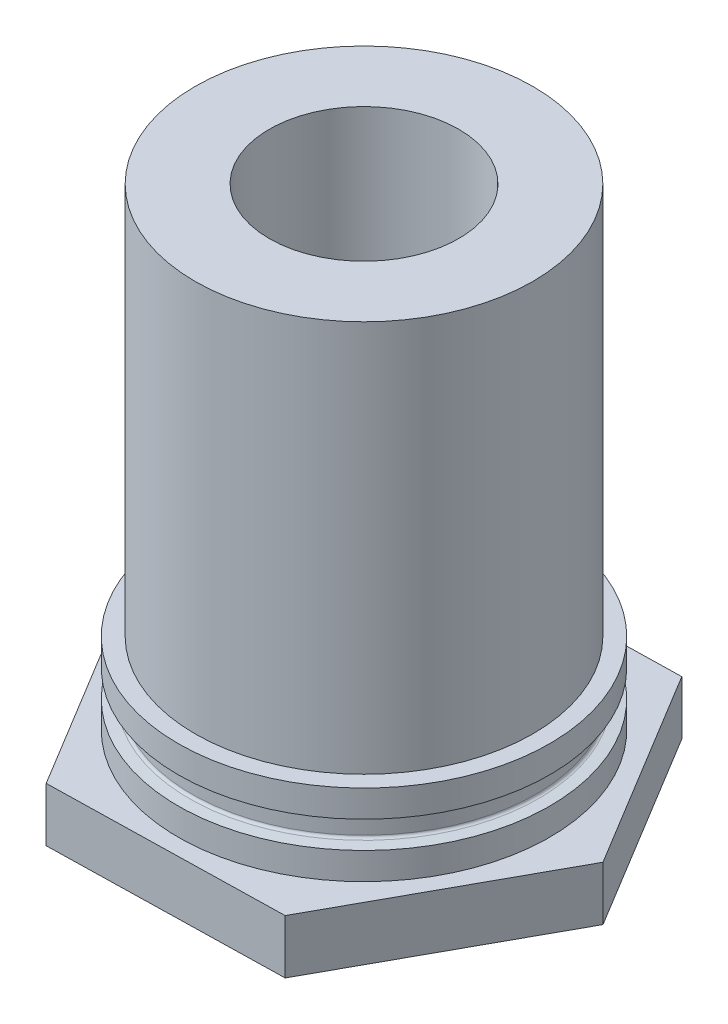
ISO-10303-21;
HEADER;
FILE_DESCRIPTION(('STEP AP214'),'2;1');
FILE_NAME('part.step','',(''),(''),'','','');
FILE_SCHEMA(('AUTOMOTIVE_DESIGN { 1 0 10303 214 1 1 1 1 }'));
ENDSEC;
DATA;
#1=APPLICATION_CONTEXT('core data for automotive mechanical design processes');
#2=APPLICATION_PROTOCOL_DEFINITION('international standard','automotive_design',2000,#1);
#3=PRODUCT_CONTEXT('',#1,'mechanical');
#4=PRODUCT('Part','Part','',(#3));
#5=PRODUCT_RELATED_PRODUCT_CATEGORY('part','',(#4));
#6=PRODUCT_DEFINITION_FORMATION('','',#4);
#7=PRODUCT_DEFINITION_CONTEXT('part definition',#1,'design');
#8=PRODUCT_DEFINITION('design','',#6,#7);
#9=PRODUCT_DEFINITION_SHAPE('','',#8);
#10=(LENGTH_UNIT() NAMED_UNIT(*) SI_UNIT(.MILLI.,.METRE.));
#11=(NAMED_UNIT(*) PLANE_ANGLE_UNIT() SI_UNIT($,.RADIAN.));
#12=(NAMED_UNIT(*) SI_UNIT($,.STERADIAN.) SOLID_ANGLE_UNIT());
#13=UNCERTAINTY_MEASURE_WITH_UNIT(LENGTH_MEASURE(1.E-05),#10,'distance_accuracy_value','');
#14=(GEOMETRIC_REPRESENTATION_CONTEXT(3) GLOBAL_UNCERTAINTY_ASSIGNED_CONTEXT((#13)) GLOBAL_UNIT_ASSIGNED_CONTEXT((#10,
#11,#12)) REPRESENTATION_CONTEXT('',''));
#15=CARTESIAN_POINT('',(0.,0.,0.));
#16=DIRECTION('',(0.,0.,1.));
#17=DIRECTION('',(1.,0.,0.));
#18=AXIS2_PLACEMENT_3D('',#15,#16,#17);
#19=CARTESIAN_POINT('',(0.,110.151211274222,0.));
#20=DIRECTION('',(0.,1.,0.));
#21=DIRECTION('',(0.,0.,1.));
#22=AXIS2_PLACEMENT_3D('',#19,#20,#21);
#23=CYLINDRICAL_SURFACE('',#22,17.4625);
#24=CARTESIAN_POINT('',(0.,5.08192526756477,0.));
#25=DIRECTION('',(0.,1.,0.));
#26=DIRECTION('',(0.,0.,1.));
#27=AXIS2_PLACEMENT_3D('',#24,#25,#26);
#28=CIRCLE('',#27,17.4625);
#29=CARTESIAN_POINT('',(0.,5.08192526756477,17.4625));
#30=VERTEX_POINT('',#29);
#31=EDGE_CURVE('E38',#30,#30,#28,.F.);
#32=ORIENTED_EDGE('',*,*,#31,.F.);
#33=EDGE_LOOP('',(#32));
#34=FACE_BOUND('',#33,.T.);
#35=CARTESIAN_POINT('',(0.,7.62,0.));
#36=DIRECTION('',(0.,1.,0.));
#37=DIRECTION('',(0.,0.,1.));
#38=AXIS2_PLACEMENT_3D('',#35,#36,#37);
#39=CIRCLE('',#38,17.4625);
#40=CARTESIAN_POINT('',(0.,7.62,17.4625));
#41=VERTEX_POINT('',#40);
#42=EDGE_CURVE('E151',#41,#41,#39,.T.);
#43=ORIENTED_EDGE('',*,*,#42,.F.);
#44=EDGE_LOOP('',(#43));
#45=FACE_BOUND('',#44,.T.);
#46=ADVANCED_FACE('F34',(#34,#45),#23,.T.);
#47=CARTESIAN_POINT('',(0.,110.151211274222,0.));
#48=DIRECTION('',(0.,1.,0.));
#49=DIRECTION('',(0.,0.,1.));
#50=AXIS2_PLACEMENT_3D('',#47,#48,#49);
#51=CYLINDRICAL_SURFACE('',#50,8.90651);
#52=CARTESIAN_POINT('',(0.,44.45,0.));
#53=DIRECTION('',(0.,1.,0.));
#54=DIRECTION('',(0.,0.,1.));
#55=AXIS2_PLACEMENT_3D('',#52,#53,#54);
#56=CIRCLE('',#55,8.90651);
#57=CARTESIAN_POINT('',(0.,44.45,8.90651));
#58=VERTEX_POINT('',#57);
#59=EDGE_CURVE('E11',#58,#58,#56,.T.);
#60=ORIENTED_EDGE('',*,*,#59,.T.);
#61=EDGE_LOOP('',(#60));
#62=FACE_BOUND('',#61,.T.);
#63=CARTESIAN_POINT('',(0.,30.988,0.));
#64=DIRECTION('',(0.,1.,0.));
#65=DIRECTION('',(0.,0.,1.));
#66=AXIS2_PLACEMENT_3D('',#63,#64,#65);
#67=CIRCLE('',#66,8.90651);
#68=CARTESIAN_POINT('',(0.,30.988,8.90651));
#69=VERTEX_POINT('',#68);
#70=EDGE_CURVE('E145',#69,#69,#67,.T.);
#71=ORIENTED_EDGE('',*,*,#70,.F.);
#72=EDGE_LOOP('',(#71));
#73=FACE_BOUND('',#72,.T.);
#74=ADVANCED_FACE('F36',(#62,#73),#51,.F.);
#75=CARTESIAN_POINT('',(-15.875,44.45,0.));
#76=DIRECTION('',(0.,1.,0.));
#77=DIRECTION('',(0.,0.,1.));
#78=AXIS2_PLACEMENT_3D('',#75,#76,#77);
#79=PLANE('',#78);
#80=CARTESIAN_POINT('',(0.,44.45,0.));
#81=DIRECTION('',(0.,1.,0.));
#82=DIRECTION('',(0.,0.,1.));
#83=AXIS2_PLACEMENT_3D('',#80,#81,#82);
#84=CIRCLE('',#83,15.875);
#85=CARTESIAN_POINT('',(0.,44.45,15.875));
#86=VERTEX_POINT('',#85);
#87=EDGE_CURVE('E44',#86,#86,#84,.T.);
#88=ORIENTED_EDGE('',*,*,#87,.T.);
#89=EDGE_LOOP('',(#88));
#90=FACE_BOUND('',#89,.T.);
#91=ORIENTED_EDGE('',*,*,#59,.F.);
#92=EDGE_LOOP('',(#91));
#93=FACE_BOUND('',#92,.T.);
#94=ADVANCED_FACE('F209',(#90,#93),#79,.T.);
#95=CARTESIAN_POINT('',(0.,110.151211274222,0.));
#96=DIRECTION('',(0.,1.,0.));
#97=DIRECTION('',(0.,0.,1.));
#98=AXIS2_PLACEMENT_3D('',#95,#96,#97);
#99=CYLINDRICAL_SURFACE('',#98,15.875);
#100=CARTESIAN_POINT('',(0.,7.62,0.));
#101=DIRECTION('',(0.,1.,0.));
#102=DIRECTION('',(0.,0.,1.));
#103=AXIS2_PLACEMENT_3D('',#100,#101,#102);
#104=CIRCLE('',#103,15.875);
#105=CARTESIAN_POINT('',(0.,7.62,15.875));
#106=VERTEX_POINT('',#105);
#107=EDGE_CURVE('E154',#106,#106,#104,.T.);
#108=ORIENTED_EDGE('',*,*,#107,.T.);
#109=EDGE_LOOP('',(#108));
#110=FACE_BOUND('',#109,.T.);
#111=ORIENTED_EDGE('',*,*,#87,.F.);
#112=EDGE_LOOP('',(#111));
#113=FACE_BOUND('',#112,.T.);
#114=ADVANCED_FACE('F225',(#110,#113),#99,.T.);
#115=CARTESIAN_POINT('',(-15.875,7.62,0.));
#116=DIRECTION('',(0.,1.,0.));
#117=DIRECTION('',(0.,0.,1.));
#118=AXIS2_PLACEMENT_3D('',#115,#116,#117);
#119=PLANE('',#118);
#120=ORIENTED_EDGE('',*,*,#42,.T.);
#121=EDGE_LOOP('',(#120));
#122=FACE_BOUND('',#121,.T.);
#123=ORIENTED_EDGE('',*,*,#107,.F.);
#124=EDGE_LOOP('',(#123));
#125=FACE_BOUND('',#124,.T.);
#126=ADVANCED_FACE('F217',(#122,#125),#119,.T.);
#127=CARTESIAN_POINT('',(0.,2.53807473243525,0.));
#128=DIRECTION('',(0.,-1.,0.));
#129=DIRECTION('',(0.,0.,-1.));
#130=AXIS2_PLACEMENT_3D('',#127,#128,#129);
#131=CIRCLE('',#130,17.4625);
#132=CARTESIAN_POINT('',(0.,2.53807473243525,-17.4625));
#133=VERTEX_POINT('',#132);
#134=EDGE_CURVE('E158',#133,#133,#131,.F.);
#135=ORIENTED_EDGE('',*,*,#134,.F.);
#136=EDGE_LOOP('',(#135));
#137=FACE_BOUND('',#136,.T.);
#138=CARTESIAN_POINT('',(0.,0.,0.));
#139=DIRECTION('',(0.,-1.,0.));
#140=DIRECTION('',(0.,0.,-1.));
#141=AXIS2_PLACEMENT_3D('',#138,#139,#140);
#142=CIRCLE('',#141,17.4625);
#143=CARTESIAN_POINT('',(0.,0.,-17.4625));
#144=VERTEX_POINT('',#143);
#145=EDGE_CURVE('E142',#144,#144,#142,.F.);
#146=ORIENTED_EDGE('',*,*,#145,.T.);
#147=EDGE_LOOP('',(#146));
#148=FACE_BOUND('',#147,.T.);
#149=ADVANCED_FACE('F205',(#137,#148),#23,.T.);
#150=CARTESIAN_POINT('',(0.,26.3398,0.));
#151=DIRECTION('',(0.,1.,0.));
#152=DIRECTION('',(0.,0.,1.));
#153=AXIS2_PLACEMENT_3D('',#150,#151,#152);
#154=CONICAL_SURFACE('',#153,2.2098,0.785398163397448);
#155=CARTESIAN_POINT('',(0.,30.988,0.));
#156=DIRECTION('',(0.,1.,0.));
#157=DIRECTION('',(0.,0.,1.));
#158=AXIS2_PLACEMENT_3D('',#155,#156,#157);
#159=CIRCLE('',#158,6.858);
#160=CARTESIAN_POINT('',(0.,30.988,6.858));
#161=VERTEX_POINT('',#160);
#162=EDGE_CURVE('E148',#161,#161,#159,.T.);
#163=CARTESIAN_POINT('',(0.,26.3398,0.));
#164=DIRECTION('',(0.,1.,0.));
#165=DIRECTION('',(0.,0.,1.));
#166=AXIS2_PLACEMENT_3D('',#163,#164,#165);
#167=CIRCLE('',#166,2.20979999999997);
#168=CARTESIAN_POINT('',(0.,26.3398,2.2098));
#169=VERTEX_POINT('',#168);
#170=EDGE_CURVE('E164',#169,#169,#167,.T.);
#171=CARTESIAN_POINT('',(0.,30.988,6.858));
#172=CARTESIAN_POINT('',(0.,30.93958125,6.80958125));
#173=CARTESIAN_POINT('',(0.,30.8911625,6.7611625));
#174=CARTESIAN_POINT('',(0.,30.794325,6.664325));
#175=CARTESIAN_POINT('',(0.,30.74590625,6.61590625));
#176=CARTESIAN_POINT('',(0.,30.64906875,6.51906875));
#177=CARTESIAN_POINT('',(0.,30.60065,6.47065));
#178=CARTESIAN_POINT('',(0.,30.5038125,6.3738125));
#179=CARTESIAN_POINT('',(0.,30.45539375,6.32539375));
#180=CARTESIAN_POINT('',(0.,30.35855625,6.22855625));
#181=CARTESIAN_POINT('',(0.,30.3101375,6.1801375));
#182=CARTESIAN_POINT('',(0.,30.2133,6.0833));
#183=CARTESIAN_POINT('',(0.,30.16488125,6.03488125));
#184=CARTESIAN_POINT('',(0.,30.06804375,5.93804375));
#185=CARTESIAN_POINT('',(0.,30.019625,5.889625));
#186=CARTESIAN_POINT('',(0.,29.9227875,5.7927875));
#187=CARTESIAN_POINT('',(0.,29.87436875,5.74436875));
#188=CARTESIAN_POINT('',(0.,29.77753125,5.64753125));
#189=CARTESIAN_POINT('',(0.,29.7291125,5.5991125));
#190=CARTESIAN_POINT('',(0.,29.632275,5.502275));
#191=CARTESIAN_POINT('',(0.,29.58385625,5.45385625));
#192=CARTESIAN_POINT('',(0.,29.48701875,5.35701875));
#193=CARTESIAN_POINT('',(0.,29.4386,5.3086));
#194=CARTESIAN_POINT('',(0.,29.3417625,5.2117625));
#195=CARTESIAN_POINT('',(0.,29.29334375,5.16334375));
#196=CARTESIAN_POINT('',(0.,29.19650625,5.06650625));
#197=CARTESIAN_POINT('',(0.,29.1480875,5.0180875));
#198=CARTESIAN_POINT('',(0.,29.05125,4.92125));
#199=CARTESIAN_POINT('',(0.,29.00283125,4.87283125));
#200=CARTESIAN_POINT('',(0.,28.90599375,4.77599375));
#201=CARTESIAN_POINT('',(0.,28.857575,4.727575));
#202=CARTESIAN_POINT('',(0.,28.7607375,4.6307375));
#203=CARTESIAN_POINT('',(0.,28.71231875,4.58231875));
#204=CARTESIAN_POINT('',(0.,28.61548125,4.48548125));
#205=CARTESIAN_POINT('',(0.,28.5670625,4.4370625));
#206=CARTESIAN_POINT('',(0.,28.470225,4.340225));
#207=CARTESIAN_POINT('',(0.,28.42180625,4.29180625));
#208=CARTESIAN_POINT('',(0.,28.32496875,4.19496875));
#209=CARTESIAN_POINT('',(0.,28.27655,4.14655));
#210=CARTESIAN_POINT('',(0.,28.1797125,4.0497125));
#211=CARTESIAN_POINT('',(0.,28.13129375,4.00129375));
#212=CARTESIAN_POINT('',(0.,28.03445625,3.90445625));
#213=CARTESIAN_POINT('',(0.,27.9860375,3.8560375));
#214=CARTESIAN_POINT('',(0.,27.8892,3.7592));
#215=CARTESIAN_POINT('',(0.,27.84078125,3.71078125));
#216=CARTESIAN_POINT('',(0.,27.74394375,3.61394375));
#217=CARTESIAN_POINT('',(0.,27.695525,3.565525));
#218=CARTESIAN_POINT('',(0.,27.5986875,3.4686875));
#219=CARTESIAN_POINT('',(0.,27.55026875,3.42026875));
#220=CARTESIAN_POINT('',(0.,27.45343125,3.32343125));
#221=CARTESIAN_POINT('',(0.,27.4050125,3.2750125));
#222=CARTESIAN_POINT('',(0.,27.308175,3.178175));
#223=CARTESIAN_POINT('',(0.,27.25975625,3.12975625));
#224=CARTESIAN_POINT('',(0.,27.16291875,3.03291875));
#225=CARTESIAN_POINT('',(0.,27.1145,2.9845));
#226=CARTESIAN_POINT('',(0.,27.0176625,2.8876625));
#227=CARTESIAN_POINT('',(0.,26.96924375,2.83924375));
#228=CARTESIAN_POINT('',(0.,26.87240625,2.74240625));
#229=CARTESIAN_POINT('',(0.,26.8239875,2.6939875));
#230=CARTESIAN_POINT('',(0.,26.72715,2.59715));
#231=CARTESIAN_POINT('',(0.,26.67873125,2.54873125));
#232=CARTESIAN_POINT('',(0.,26.58189375,2.45189375));
#233=CARTESIAN_POINT('',(0.,26.533475,2.403475));
#234=CARTESIAN_POINT('',(0.,26.4366375,2.3066375));
#235=CARTESIAN_POINT('',(0.,26.38821875,2.25821875));
#236=CARTESIAN_POINT('',(0.,26.3398,2.2098));
#237=B_SPLINE_CURVE_WITH_KNOTS('',3,(#171,#172,#173,#174,#175,#176,#177,#178,#179,#180,#181,
#182,#183,#184,#185,#186,#187,#188,#189,#190,#191,#192,#193,#194,#195,#196,#197,#198,#199,#200,
#201,#202,#203,#204,#205,#206,#207,#208,#209,#210,#211,#212,#213,#214,#215,#216,#217,#218,#219,
#220,#221,#222,#223,#224,#225,#226,#227,#228,#229,#230,#231,#232,#233,#234,#235,#236),
.UNSPECIFIED.,.F.,.F.,(4,2,2,2,2,2,2,2,2,2,2,2,2,2,2,2,2,2,2,2,2,2,2,2,2,2,2,2,2,2,2,2,4),(0.,
0.205423358769459,0.410846717538916,0.616270076308373,0.82169343507783,1.02711679384729,
1.23254015261674,1.4379635113862,1.64338687015566,1.84881022892512,2.05423358769457,
2.25965694646403,2.46508030523349,2.67050366400294,2.8759270227724,3.08135038154186,
3.28677374031131,3.49219709908077,3.69762045785023,3.90304381661969,4.10846717538914,
4.3138905341586,4.51931389292806,4.72473725169751,4.93016061046697,5.13558396923643,
5.34100732800589,5.54643068677534,5.7518540455448,5.95727740431426,6.16270076308371,
6.36812412185317,6.57354748062262),.UNSPECIFIED.);
#238=EDGE_CURVE('BSEAM216',#161,#169,#237,.T.);
#239=ORIENTED_EDGE('',*,*,#162,.T.);
#240=ORIENTED_EDGE('',*,*,#170,.F.);
#241=ORIENTED_EDGE('',*,*,#238,.T.);
#242=ORIENTED_EDGE('',*,*,#238,.F.);
#243=EDGE_LOOP('',(#239,#241,#240,#242));
#244=FACE_BOUND('',#243,.T.);
#245=ADVANCED_FACE('F216',(#244),#154,.F.);
#246=CARTESIAN_POINT('',(-8.90651,30.988,0.));
#247=DIRECTION('',(0.,1.,0.));
#248=DIRECTION('',(0.,0.,1.));
#249=AXIS2_PLACEMENT_3D('',#246,#247,#248);
#250=PLANE('',#249);
#251=ORIENTED_EDGE('',*,*,#70,.T.);
#252=EDGE_LOOP('',(#251));
#253=FACE_BOUND('',#252,.T.);
#254=ORIENTED_EDGE('',*,*,#162,.F.);
#255=EDGE_LOOP('',(#254));
#256=FACE_BOUND('',#255,.T.);
#257=ADVANCED_FACE('F223',(#253,#256),#250,.T.);
#258=CARTESIAN_POINT('',(-10.5891393054103,-5.08,19.2805634972273));
#259=DIRECTION('',(0.855148733490636,0.,-0.518382719242609));
#260=DIRECTION('',(-0.518382719242609,0.,-0.855148733490636));
#261=AXIS2_PLACEMENT_3D('',#258,#259,#260);
#262=PLANE('',#261);
#263=DIRECTION('',(-0.518382719242609,0.,-0.855148733490636));
#264=VECTOR('',#263,1.);
#265=CARTESIAN_POINT('',(-10.5891393054103,0.,19.2805634972273));
#266=LINE('',#265,#264);
#267=CARTESIAN_POINT('',(-10.5891393054103,0.,19.2805634972273));
#268=VERTEX_POINT('',#267);
#269=CARTESIAN_POINT('',(-21.9920274405829,0.,0.469818105916068));
#270=VERTEX_POINT('',#269);
#271=EDGE_CURVE('E122',#268,#270,#266,.T.);
#272=ORIENTED_EDGE('',*,*,#271,.T.);
#273=DIRECTION('',(0.,1.,0.));
#274=VECTOR('',#273,1.);
#275=CARTESIAN_POINT('',(-21.9920274405829,-5.08,0.469818105916068));
#276=LINE('',#275,#274);
#277=CARTESIAN_POINT('',(-21.9920274405829,-5.08,0.469818105916068));
#278=VERTEX_POINT('',#277);
#279=EDGE_CURVE('E140',#278,#270,#276,.T.);
#280=ORIENTED_EDGE('',*,*,#279,.F.);
#281=DIRECTION('',(-0.518382719242609,0.,-0.855148733490636));
#282=VECTOR('',#281,1.);
#283=CARTESIAN_POINT('',(-10.5891393054103,-5.08,19.2805634972273));
#284=LINE('',#283,#282);
#285=CARTESIAN_POINT('',(-10.5891393054103,-5.08,19.2805634972273));
#286=VERTEX_POINT('',#285);
#287=EDGE_CURVE('E133',#286,#278,#284,.T.);
#288=ORIENTED_EDGE('',*,*,#287,.F.);
#289=DIRECTION('',(0.,1.,0.));
#290=VECTOR('',#289,1.);
#291=CARTESIAN_POINT('',(-10.5891393054103,-5.08,19.2805634972273));
#292=LINE('',#291,#290);
#293=EDGE_CURVE('E118',#286,#268,#292,.T.);
#294=ORIENTED_EDGE('',*,*,#293,.T.);
#295=EDGE_LOOP('',(#272,#280,#288,#294));
#296=FACE_BOUND('',#295,.T.);
#297=ADVANCED_FACE('F190',(#296),#262,.F.);
#298=CARTESIAN_POINT('',(-21.9920274405829,-5.08,0.469818105916068));
#299=DIRECTION('',(0.876506970492274,0.,0.481389167595674));
#300=DIRECTION('',(0.481389167595675,0.,-0.876506970492274));
#301=AXIS2_PLACEMENT_3D('',#298,#299,#300);
#302=PLANE('',#301);
#303=DIRECTION('',(0.481389167595675,0.,-0.876506970492274));
#304=VECTOR('',#303,1.);
#305=CARTESIAN_POINT('',(-21.9920274405829,0.,0.469818105916068));
#306=LINE('',#305,#304);
#307=CARTESIAN_POINT('',(-11.4028881351727,0.,-18.8107453913113));
#308=VERTEX_POINT('',#307);
#309=EDGE_CURVE('E125',#270,#308,#306,.T.);
#310=ORIENTED_EDGE('',*,*,#309,.T.);
#311=DIRECTION('',(0.,1.,0.));
#312=VECTOR('',#311,1.);
#313=CARTESIAN_POINT('',(-11.4028881351727,-5.08,-18.8107453913113));
#314=LINE('',#313,#312);
#315=CARTESIAN_POINT('',(-11.4028881351727,-5.08,-18.8107453913113));
#316=VERTEX_POINT('',#315);
#317=EDGE_CURVE('E137',#316,#308,#314,.T.);
#318=ORIENTED_EDGE('',*,*,#317,.F.);
#319=DIRECTION('',(0.481389167595675,0.,-0.876506970492274));
#320=VECTOR('',#319,1.);
#321=CARTESIAN_POINT('',(-21.9920274405829,-5.08,0.469818105916068));
#322=LINE('',#321,#320);
#323=EDGE_CURVE('E91',#278,#316,#322,.T.);
#324=ORIENTED_EDGE('',*,*,#323,.F.);
#325=ORIENTED_EDGE('',*,*,#279,.T.);
#326=EDGE_LOOP('',(#310,#318,#324,#325));
#327=FACE_BOUND('',#326,.T.);
#328=ADVANCED_FACE('F182',(#327),#302,.F.);
#329=CARTESIAN_POINT('',(-11.4028881351727,-5.08,-18.8107453913113));
#330=DIRECTION('',(0.0213582370016381,0.,0.999771886838284));
#331=DIRECTION('',(0.999771886838284,0.,-0.0213582370016381));
#332=AXIS2_PLACEMENT_3D('',#329,#330,#331);
#333=PLANE('',#332);
#334=DIRECTION('',(0.999771886838284,0.,-0.0213582370016381));
#335=VECTOR('',#334,1.);
#336=CARTESIAN_POINT('',(-11.4028881351727,0.,-18.8107453913113));
#337=LINE('',#336,#335);
#338=CARTESIAN_POINT('',(10.5891393054103,0.,-19.2805634972273));
#339=VERTEX_POINT('',#338);
#340=EDGE_CURVE('E128',#308,#339,#337,.T.);
#341=ORIENTED_EDGE('',*,*,#340,.T.);
#342=DIRECTION('',(0.,1.,0.));
#343=VECTOR('',#342,1.);
#344=CARTESIAN_POINT('',(10.5891393054103,-5.08,-19.2805634972273));
#345=LINE('',#344,#343);
#346=CARTESIAN_POINT('',(10.5891393054103,-5.08,-19.2805634972273));
#347=VERTEX_POINT('',#346);
#348=EDGE_CURVE('E113',#347,#339,#345,.T.);
#349=ORIENTED_EDGE('',*,*,#348,.F.);
#350=DIRECTION('',(0.999771886838284,0.,-0.0213582370016381));
#351=VECTOR('',#350,1.);
#352=CARTESIAN_POINT('',(-11.4028881351727,-5.08,-18.8107453913113));
#353=LINE('',#352,#351);
#354=EDGE_CURVE('E104',#316,#347,#353,.T.);
#355=ORIENTED_EDGE('',*,*,#354,.F.);
#356=ORIENTED_EDGE('',*,*,#317,.T.);
#357=EDGE_LOOP('',(#341,#349,#355,#356));
#358=FACE_BOUND('',#357,.T.);
#359=ADVANCED_FACE('F185',(#358),#333,.F.);
#360=CARTESIAN_POINT('',(10.5891393054103,-5.08,-19.2805634972273));
#361=DIRECTION('',(-0.855148733490635,0.,0.518382719242609));
#362=DIRECTION('',(0.518382719242609,0.,0.855148733490636));
#363=AXIS2_PLACEMENT_3D('',#360,#361,#362);
#364=PLANE('',#363);
#365=DIRECTION('',(0.518382719242609,0.,0.855148733490636));
#366=VECTOR('',#365,1.);
#367=CARTESIAN_POINT('',(10.5891393054103,0.,-19.2805634972273));
#368=LINE('',#367,#366);
#369=CARTESIAN_POINT('',(21.9920274405829,0.,-0.469818105916082));
#370=VERTEX_POINT('',#369);
#371=EDGE_CURVE('E112',#339,#370,#368,.T.);
#372=ORIENTED_EDGE('',*,*,#371,.T.);
#373=DIRECTION('',(0.,1.,0.));
#374=VECTOR('',#373,1.);
#375=CARTESIAN_POINT('',(21.9920274405829,-5.08,-0.469818105916082));
#376=LINE('',#375,#374);
#377=CARTESIAN_POINT('',(21.9920274405829,-5.08,-0.469818105916082));
#378=VERTEX_POINT('',#377);
#379=EDGE_CURVE('E109',#378,#370,#376,.T.);
#380=ORIENTED_EDGE('',*,*,#379,.F.);
#381=DIRECTION('',(0.518382719242609,0.,0.855148733490636));
#382=VECTOR('',#381,1.);
#383=CARTESIAN_POINT('',(10.5891393054103,-5.08,-19.2805634972273));
#384=LINE('',#383,#382);
#385=EDGE_CURVE('E98',#347,#378,#384,.T.);
#386=ORIENTED_EDGE('',*,*,#385,.F.);
#387=ORIENTED_EDGE('',*,*,#348,.T.);
#388=EDGE_LOOP('',(#372,#380,#386,#387));
#389=FACE_BOUND('',#388,.T.);
#390=ADVANCED_FACE('F110',(#389),#364,.F.);
#391=CARTESIAN_POINT('',(21.9920274405829,-5.08,-0.469818105916082));
#392=DIRECTION('',(-0.876506970492274,0.,-0.481389167595674));
#393=DIRECTION('',(-0.481389167595674,0.,0.876506970492274));
#394=AXIS2_PLACEMENT_3D('',#391,#392,#393);
#395=PLANE('',#394);
#396=DIRECTION('',(-0.481389167595674,0.,0.876506970492274));
#397=VECTOR('',#396,1.);
#398=CARTESIAN_POINT('',(21.9920274405829,0.,-0.469818105916082));
#399=LINE('',#398,#397);
#400=CARTESIAN_POINT('',(11.4028881351727,0.,18.8107453913113));
#401=VERTEX_POINT('',#400);
#402=EDGE_CURVE('E76',#370,#401,#399,.T.);
#403=ORIENTED_EDGE('',*,*,#402,.T.);
#404=DIRECTION('',(0.,1.,0.));
#405=VECTOR('',#404,1.);
#406=CARTESIAN_POINT('',(11.4028881351727,-5.08,18.8107453913113));
#407=LINE('',#406,#405);
#408=CARTESIAN_POINT('',(11.4028881351727,-5.08,18.8107453913113));
#409=VERTEX_POINT('',#408);
#410=EDGE_CURVE('E114',#409,#401,#407,.T.);
#411=ORIENTED_EDGE('',*,*,#410,.F.);
#412=DIRECTION('',(-0.481389167595674,0.,0.876506970492274));
#413=VECTOR('',#412,1.);
#414=CARTESIAN_POINT('',(21.9920274405829,-5.08,-0.469818105916082));
#415=LINE('',#414,#413);
#416=EDGE_CURVE('E102',#378,#409,#415,.T.);
#417=ORIENTED_EDGE('',*,*,#416,.F.);
#418=ORIENTED_EDGE('',*,*,#379,.T.);
#419=EDGE_LOOP('',(#403,#411,#417,#418));
#420=FACE_BOUND('',#419,.T.);
#421=ADVANCED_FACE('F116',(#420),#395,.F.);
#422=CARTESIAN_POINT('',(11.4028881351727,-5.08,18.8107453913113));
#423=DIRECTION('',(-0.0213582370016381,0.,-0.999771886838284));
#424=DIRECTION('',(-0.999771886838284,0.,0.0213582370016381));
#425=AXIS2_PLACEMENT_3D('',#422,#423,#424);
#426=PLANE('',#425);
#427=DIRECTION('',(-0.999771886838284,0.,0.0213582370016381));
#428=VECTOR('',#427,1.);
#429=CARTESIAN_POINT('',(11.4028881351727,0.,18.8107453913113));
#430=LINE('',#429,#428);
#431=EDGE_CURVE('E82',#401,#268,#430,.T.);
#432=ORIENTED_EDGE('',*,*,#431,.T.);
#433=ORIENTED_EDGE('',*,*,#293,.F.);
#434=DIRECTION('',(-0.999771886838284,0.,0.0213582370016381));
#435=VECTOR('',#434,1.);
#436=CARTESIAN_POINT('',(11.4028881351727,-5.08,18.8107453913113));
#437=LINE('',#436,#435);
#438=EDGE_CURVE('E53',#409,#286,#437,.T.);
#439=ORIENTED_EDGE('',*,*,#438,.F.);
#440=ORIENTED_EDGE('',*,*,#410,.T.);
#441=EDGE_LOOP('',(#432,#433,#439,#440));
#442=FACE_BOUND('',#441,.T.);
#443=ADVANCED_FACE('F191',(#442),#426,.F.);
#444=CARTESIAN_POINT('',(0.,-5.08,0.));
#445=DIRECTION('',(0.,-1.,0.));
#446=DIRECTION('',(0.,0.,-1.));
#447=AXIS2_PLACEMENT_3D('',#444,#445,#446);
#448=PLANE('',#447);
#449=CARTESIAN_POINT('',(0.,-5.08,0.));
#450=DIRECTION('',(0.,1.,0.));
#451=DIRECTION('',(0.,0.,1.));
#452=AXIS2_PLACEMENT_3D('',#449,#450,#451);
#453=CIRCLE('',#452,2.20979999999997);
#454=CARTESIAN_POINT('',(0.,-5.08,2.20979999999997));
#455=VERTEX_POINT('',#454);
#456=EDGE_CURVE('E126',#455,#455,#453,.T.);
#457=ORIENTED_EDGE('',*,*,#456,.T.);
#458=EDGE_LOOP('',(#457));
#459=FACE_BOUND('',#458,.T.);
#460=ORIENTED_EDGE('',*,*,#287,.T.);
#461=ORIENTED_EDGE('',*,*,#323,.T.);
#462=ORIENTED_EDGE('',*,*,#354,.T.);
#463=ORIENTED_EDGE('',*,*,#385,.T.);
#464=ORIENTED_EDGE('',*,*,#416,.T.);
#465=ORIENTED_EDGE('',*,*,#438,.T.);
#466=EDGE_LOOP('',(#460,#461,#462,#463,#464,#465));
#467=FACE_BOUND('',#466,.T.);
#468=ADVANCED_FACE('F100',(#459,#467),#448,.T.);
#469=CARTESIAN_POINT('',(0.,0.,0.));
#470=DIRECTION('',(0.,-1.,0.));
#471=DIRECTION('',(0.,0.,-1.));
#472=AXIS2_PLACEMENT_3D('',#469,#470,#471);
#473=PLANE('',#472);
#474=ORIENTED_EDGE('',*,*,#145,.F.);
#475=EDGE_LOOP('',(#474));
#476=FACE_BOUND('',#475,.T.);
#477=ORIENTED_EDGE('',*,*,#271,.F.);
#478=ORIENTED_EDGE('',*,*,#431,.F.);
#479=ORIENTED_EDGE('',*,*,#402,.F.);
#480=ORIENTED_EDGE('',*,*,#371,.F.);
#481=ORIENTED_EDGE('',*,*,#340,.F.);
#482=ORIENTED_EDGE('',*,*,#309,.F.);
#483=EDGE_LOOP('',(#477,#478,#479,#480,#481,#482));
#484=FACE_BOUND('',#483,.T.);
#485=ADVANCED_FACE('F188',(#476,#484),#473,.F.);
#486=CARTESIAN_POINT('',(0.,-5.08,0.));
#487=DIRECTION('',(0.,1.,0.));
#488=DIRECTION('',(0.,0.,1.));
#489=AXIS2_PLACEMENT_3D('',#486,#487,#488);
#490=CYLINDRICAL_SURFACE('',#489,2.20979999999997);
#491=ORIENTED_EDGE('',*,*,#456,.F.);
#492=EDGE_LOOP('',(#491));
#493=FACE_BOUND('',#492,.T.);
#494=ORIENTED_EDGE('',*,*,#170,.T.);
#495=EDGE_LOOP('',(#494));
#496=FACE_BOUND('',#495,.T.);
#497=ADVANCED_FACE('F231',(#493,#496),#490,.F.);
#498=CARTESIAN_POINT('',(0.,4.73806654668468,0.));
#499=DIRECTION('',(0.,-1.,0.));
#500=DIRECTION('',(0.,0.,-1.));
#501=AXIS2_PLACEMENT_3D('',#498,#499,#500);
#502=TOROIDAL_SURFACE('',#501,16.4464999999804,0.254000000000006);
#503=CARTESIAN_POINT('',(0.,4.73806654668471,0.));
#504=DIRECTION('',(0.,-1.,0.));
#505=DIRECTION('',(0.,0.,-1.));
#506=AXIS2_PLACEMENT_3D('',#503,#504,#505);
#507=CIRCLE('',#506,16.1924999999804);
#508=CARTESIAN_POINT('',(0.,4.73806654668471,-16.1924999999804));
#509=VERTEX_POINT('',#508);
#510=EDGE_CURVE('E263',#509,#509,#507,.T.);
#511=ORIENTED_EDGE('',*,*,#510,.F.);
#512=EDGE_LOOP('',(#511));
#513=FACE_BOUND('',#512,.T.);
#514=CARTESIAN_POINT('',(0.,4.9911,0.));
#515=DIRECTION('',(0.,-1.,0.));
#516=DIRECTION('',(0.,0.,-1.));
#517=AXIS2_PLACEMENT_3D('',#514,#515,#516);
#518=CIRCLE('',#517,16.4243624413225);
#519=CARTESIAN_POINT('',(0.,4.9911,-16.4243624413225));
#520=VERTEX_POINT('',#519);
#521=EDGE_CURVE('E160',#520,#520,#518,.T.);
#522=ORIENTED_EDGE('',*,*,#521,.T.);
#523=EDGE_LOOP('',(#522));
#524=FACE_BOUND('',#523,.T.);
#525=ADVANCED_FACE('F235',(#513,#524),#502,.F.);
#526=CARTESIAN_POINT('',(0.,5.08970300975051,0.));
#527=DIRECTION('',(0.,1.,0.));
#528=DIRECTION('',(0.,0.,1.));
#529=AXIS2_PLACEMENT_3D('',#526,#527,#528);
#530=CONICAL_SURFACE('',#529,17.5513999999804,1.48352986419517);
#531=ORIENTED_EDGE('',*,*,#31,.T.);
#532=EDGE_LOOP('',(#531));
#533=FACE_BOUND('',#532,.T.);
#534=ORIENTED_EDGE('',*,*,#521,.F.);
#535=EDGE_LOOP('',(#534));
#536=FACE_BOUND('',#535,.T.);
#537=ADVANCED_FACE('F241',(#533,#536),#530,.T.);
#538=CARTESIAN_POINT('',(0.,2.62890000000002,0.));
#539=DIRECTION('',(0.,-1.,0.));
#540=DIRECTION('',(0.,0.,-1.));
#541=AXIS2_PLACEMENT_3D('',#538,#539,#540);
#542=CONICAL_SURFACE('',#541,16.4243624413225,1.48352986419517);
#543=ORIENTED_EDGE('',*,*,#134,.T.);
#544=EDGE_LOOP('',(#543));
#545=FACE_BOUND('',#544,.T.);
#546=CARTESIAN_POINT('',(0.,2.62890000000002,0.));
#547=DIRECTION('',(0.,-1.,0.));
#548=DIRECTION('',(0.,0.,-1.));
#549=AXIS2_PLACEMENT_3D('',#546,#547,#548);
#550=CIRCLE('',#549,16.4243624413225);
#551=CARTESIAN_POINT('',(0.,2.62890000000002,-16.4243624413225));
#552=VERTEX_POINT('',#551);
#553=EDGE_CURVE('E166',#552,#552,#550,.T.);
#554=ORIENTED_EDGE('',*,*,#553,.T.);
#555=EDGE_LOOP('',(#554));
#556=FACE_BOUND('',#555,.T.);
#557=ADVANCED_FACE('F245',(#545,#556),#542,.T.);
#558=CARTESIAN_POINT('',(0.,2.88193345331531,0.));
#559=DIRECTION('',(0.,-1.,0.));
#560=DIRECTION('',(0.,0.,-1.));
#561=AXIS2_PLACEMENT_3D('',#558,#559,#560);
#562=TOROIDAL_SURFACE('',#561,16.4464999999804,0.254);
#563=ORIENTED_EDGE('',*,*,#553,.F.);
#564=EDGE_LOOP('',(#563));
#565=FACE_BOUND('',#564,.T.);
#566=CARTESIAN_POINT('',(0.,2.88193345331531,0.));
#567=DIRECTION('',(0.,-1.,0.));
#568=DIRECTION('',(0.,0.,-1.));
#569=AXIS2_PLACEMENT_3D('',#566,#567,#568);
#570=CIRCLE('',#569,16.1924999999804);
#571=CARTESIAN_POINT('',(0.,2.8819334533153,-16.1924999999804));
#572=VERTEX_POINT('',#571);
#573=EDGE_CURVE('E171',#572,#572,#570,.T.);
#574=ORIENTED_EDGE('',*,*,#573,.T.);
#575=EDGE_LOOP('',(#574));
#576=FACE_BOUND('',#575,.T.);
#577=ADVANCED_FACE('F249',(#565,#576),#562,.F.);
#578=CARTESIAN_POINT('',(0.,160.151211274222,0.));
#579=DIRECTION('',(0.,-1.,0.));
#580=DIRECTION('',(0.,0.,-1.));
#581=AXIS2_PLACEMENT_3D('',#578,#579,#580);
#582=CYLINDRICAL_SURFACE('',#581,16.1924999999804);
#583=ORIENTED_EDGE('',*,*,#573,.F.);
#584=EDGE_LOOP('',(#583));
#585=FACE_BOUND('',#584,.T.);
#586=ORIENTED_EDGE('',*,*,#510,.T.);
#587=EDGE_LOOP('',(#586));
#588=FACE_BOUND('',#587,.T.);
#589=ADVANCED_FACE('F252',(#585,#588),#582,.T.);
#590=CLOSED_SHELL('',(#46,#74,#94,#114,#126,#149,#245,#257,#297,#328,#359,#390,#421,#443,#468,
#485,#497,#525,#537,#557,#577,#589));
#591=MANIFOLD_SOLID_BREP('B2',#590);
#592=ADVANCED_BREP_SHAPE_REPRESENTATION('',(#18,#591),#14);
#593=SHAPE_DEFINITION_REPRESENTATION(#9,#592);
ENDSEC;
END-ISO-10303-21;
